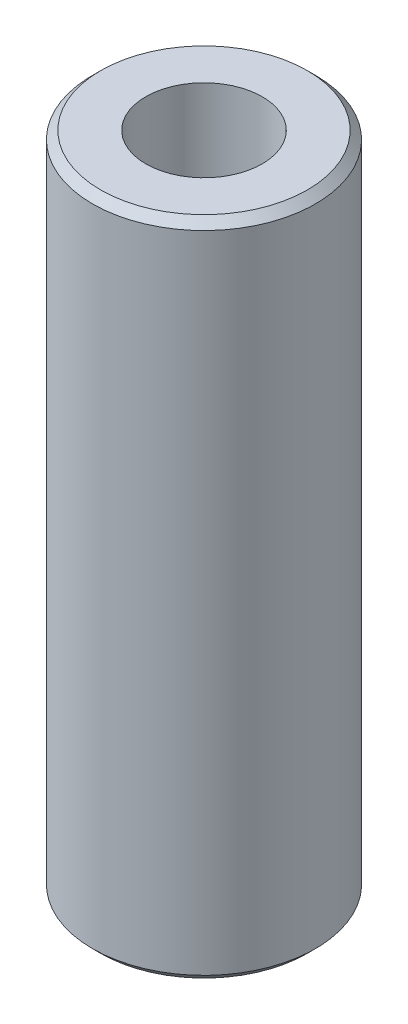
ISO-10303-21;
HEADER;
FILE_DESCRIPTION(('STEP AP214'),'2;1');
FILE_NAME('part.step','',(''),(''),'','','');
FILE_SCHEMA(('AUTOMOTIVE_DESIGN { 1 0 10303 214 1 1 1 1 }'));
ENDSEC;
DATA;
#1=APPLICATION_CONTEXT('core data for automotive mechanical design processes');
#2=APPLICATION_PROTOCOL_DEFINITION('international standard','automotive_design',2000,#1);
#3=PRODUCT_CONTEXT('',#1,'mechanical');
#4=PRODUCT('Part','Part','',(#3));
#5=PRODUCT_RELATED_PRODUCT_CATEGORY('part','',(#4));
#6=PRODUCT_DEFINITION_FORMATION('','',#4);
#7=PRODUCT_DEFINITION_CONTEXT('part definition',#1,'design');
#8=PRODUCT_DEFINITION('design','',#6,#7);
#9=PRODUCT_DEFINITION_SHAPE('','',#8);
#10=(LENGTH_UNIT() NAMED_UNIT(*) SI_UNIT(.MILLI.,.METRE.));
#11=(NAMED_UNIT(*) PLANE_ANGLE_UNIT() SI_UNIT($,.RADIAN.));
#12=(NAMED_UNIT(*) SI_UNIT($,.STERADIAN.) SOLID_ANGLE_UNIT());
#13=UNCERTAINTY_MEASURE_WITH_UNIT(LENGTH_MEASURE(1.E-05),#10,'distance_accuracy_value','');
#14=(GEOMETRIC_REPRESENTATION_CONTEXT(3) GLOBAL_UNCERTAINTY_ASSIGNED_CONTEXT((#13)) GLOBAL_UNIT_ASSIGNED_CONTEXT((#10,
#11,#12)) REPRESENTATION_CONTEXT('',''));
#15=CARTESIAN_POINT('',(0.,0.,0.));
#16=DIRECTION('',(0.,0.,1.));
#17=DIRECTION('',(1.,0.,0.));
#18=AXIS2_PLACEMENT_3D('',#15,#16,#17);
#19=CARTESIAN_POINT('',(0.,341.138244403787,0.));
#20=DIRECTION('',(0.,-1.,0.));
#21=DIRECTION('',(0.,0.,-1.));
#22=AXIS2_PLACEMENT_3D('',#19,#20,#21);
#23=CYLINDRICAL_SURFACE('',#22,57.5);
#24=CARTESIAN_POINT('',(0.,336.970531779858,0.));
#25=DIRECTION('',(0.,1.,0.));
#26=DIRECTION('',(0.,0.,1.));
#27=AXIS2_PLACEMENT_3D('',#24,#25,#26);
#28=CIRCLE('',#27,57.5);
#29=CARTESIAN_POINT('',(0.,336.970531779858,57.5));
#30=VERTEX_POINT('',#29);
#31=EDGE_CURVE('E50',#30,#30,#28,.F.);
#32=ORIENTED_EDGE('',*,*,#31,.T.);
#33=EDGE_LOOP('',(#32));
#34=FACE_BOUND('',#33,.T.);
#35=CARTESIAN_POINT('',(0.,4.16771262392845,0.));
#36=DIRECTION('',(0.,1.,0.));
#37=DIRECTION('',(0.,0.,1.));
#38=AXIS2_PLACEMENT_3D('',#35,#36,#37);
#39=CIRCLE('',#38,57.5);
#40=CARTESIAN_POINT('',(0.,4.16771262392845,57.5));
#41=VERTEX_POINT('',#40);
#42=EDGE_CURVE('E51',#41,#41,#39,.T.);
#43=ORIENTED_EDGE('',*,*,#42,.T.);
#44=EDGE_LOOP('',(#43));
#45=FACE_BOUND('',#44,.T.);
#46=ADVANCED_FACE('F39',(#34,#45),#23,.T.);
#47=CARTESIAN_POINT('',(0.,341.138244403787,0.));
#48=DIRECTION('',(0.,1.,0.));
#49=DIRECTION('',(0.,0.,1.));
#50=AXIS2_PLACEMENT_3D('',#47,#48,#49);
#51=PLANE('',#50);
#52=CARTESIAN_POINT('',(0.,341.138244403787,0.));
#53=DIRECTION('',(0.,1.,0.));
#54=DIRECTION('',(0.,0.,1.));
#55=AXIS2_PLACEMENT_3D('',#52,#53,#54);
#56=CIRCLE('',#55,53.3322873760715);
#57=CARTESIAN_POINT('',(0.,341.138244403787,53.3322873760715));
#58=VERTEX_POINT('',#57);
#59=EDGE_CURVE('E54',#58,#58,#56,.T.);
#60=ORIENTED_EDGE('',*,*,#59,.T.);
#61=EDGE_LOOP('',(#60));
#62=FACE_BOUND('',#61,.T.);
#63=CARTESIAN_POINT('',(0.,341.138244403787,0.));
#64=DIRECTION('',(0.,1.,0.));
#65=DIRECTION('',(0.,0.,1.));
#66=AXIS2_PLACEMENT_3D('',#63,#64,#65);
#67=CIRCLE('',#66,30.0368867262976);
#68=CARTESIAN_POINT('',(0.,341.138244403787,30.0368867262976));
#69=VERTEX_POINT('',#68);
#70=EDGE_CURVE('E58',#69,#69,#67,.T.);
#71=ORIENTED_EDGE('',*,*,#70,.F.);
#72=EDGE_LOOP('',(#71));
#73=FACE_BOUND('',#72,.T.);
#74=ADVANCED_FACE('F69',(#62,#73),#51,.T.);
#75=CARTESIAN_POINT('',(0.,0.,0.));
#76=DIRECTION('',(0.,1.,0.));
#77=DIRECTION('',(0.,0.,1.));
#78=AXIS2_PLACEMENT_3D('',#75,#76,#77);
#79=PLANE('',#78);
#80=CARTESIAN_POINT('',(0.,0.,0.));
#81=DIRECTION('',(0.,1.,0.));
#82=DIRECTION('',(0.,0.,1.));
#83=AXIS2_PLACEMENT_3D('',#80,#81,#82);
#84=CIRCLE('',#83,53.3322873760715);
#85=CARTESIAN_POINT('',(0.,0.,53.3322873760715));
#86=VERTEX_POINT('',#85);
#87=EDGE_CURVE('E10',#86,#86,#84,.F.);
#88=ORIENTED_EDGE('',*,*,#87,.T.);
#89=EDGE_LOOP('',(#88));
#90=FACE_BOUND('',#89,.T.);
#91=CARTESIAN_POINT('',(0.,0.,0.));
#92=DIRECTION('',(0.,1.,0.));
#93=DIRECTION('',(0.,0.,1.));
#94=AXIS2_PLACEMENT_3D('',#91,#92,#93);
#95=CIRCLE('',#94,30.0368867262976);
#96=CARTESIAN_POINT('',(0.,0.,30.0368867262976));
#97=VERTEX_POINT('',#96);
#98=EDGE_CURVE('E63',#97,#97,#95,.T.);
#99=ORIENTED_EDGE('',*,*,#98,.T.);
#100=EDGE_LOOP('',(#99));
#101=FACE_BOUND('',#100,.T.);
#102=ADVANCED_FACE('F75',(#90,#101),#79,.F.);
#103=CARTESIAN_POINT('',(0.,341.138244403787,0.));
#104=DIRECTION('',(0.,-1.,0.));
#105=DIRECTION('',(0.,0.,-1.));
#106=AXIS2_PLACEMENT_3D('',#103,#104,#105);
#107=CYLINDRICAL_SURFACE('',#106,30.0368867262976);
#108=ORIENTED_EDGE('',*,*,#70,.T.);
#109=EDGE_LOOP('',(#108));
#110=FACE_BOUND('',#109,.T.);
#111=ORIENTED_EDGE('',*,*,#98,.F.);
#112=EDGE_LOOP('',(#111));
#113=FACE_BOUND('',#112,.T.);
#114=ADVANCED_FACE('F70',(#110,#113),#107,.F.);
#115=CARTESIAN_POINT('',(0.,341.138244403787,0.));
#116=DIRECTION('',(0.,-1.,0.));
#117=DIRECTION('',(0.,0.,-1.));
#118=AXIS2_PLACEMENT_3D('',#115,#116,#117);
#119=CONICAL_SURFACE('',#118,53.3322873760715,0.785398163397449);
#120=ORIENTED_EDGE('',*,*,#31,.F.);
#121=EDGE_LOOP('',(#120));
#122=FACE_BOUND('',#121,.T.);
#123=ORIENTED_EDGE('',*,*,#59,.F.);
#124=EDGE_LOOP('',(#123));
#125=FACE_BOUND('',#124,.T.);
#126=ADVANCED_FACE('F81',(#122,#125),#119,.T.);
#127=CARTESIAN_POINT('',(0.,4.16771262392845,0.));
#128=DIRECTION('',(0.,1.,0.));
#129=DIRECTION('',(0.,0.,1.));
#130=AXIS2_PLACEMENT_3D('',#127,#128,#129);
#131=CONICAL_SURFACE('',#130,57.5,0.785398163397452);
#132=ORIENTED_EDGE('',*,*,#87,.F.);
#133=EDGE_LOOP('',(#132));
#134=FACE_BOUND('',#133,.T.);
#135=ORIENTED_EDGE('',*,*,#42,.F.);
#136=EDGE_LOOP('',(#135));
#137=FACE_BOUND('',#136,.T.);
#138=ADVANCED_FACE('F45',(#134,#137),#131,.T.);
#139=CLOSED_SHELL('',(#46,#74,#102,#114,#126,#138));
#140=MANIFOLD_SOLID_BREP('B2',#139);
#141=ADVANCED_BREP_SHAPE_REPRESENTATION('',(#18,#140),#14);
#142=SHAPE_DEFINITION_REPRESENTATION(#9,#141);
ENDSEC;
END-ISO-10303-21;
